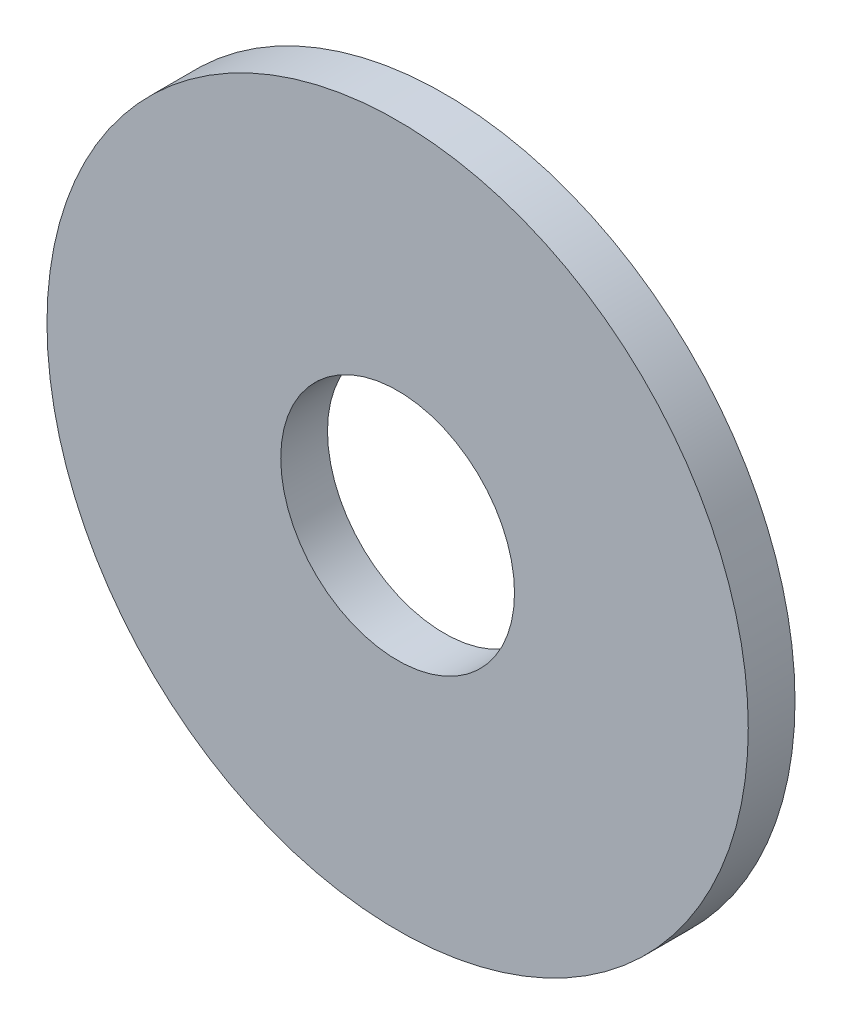
ISO-10303-21;
HEADER;
FILE_DESCRIPTION(('STEP AP214'),'2;1');
FILE_NAME('part.step','',(''),(''),'','','');
FILE_SCHEMA(('AUTOMOTIVE_DESIGN { 1 0 10303 214 1 1 1 1 }'));
ENDSEC;
DATA;
#1=APPLICATION_CONTEXT('core data for automotive mechanical design processes');
#2=APPLICATION_PROTOCOL_DEFINITION('international standard','automotive_design',2000,#1);
#3=PRODUCT_CONTEXT('',#1,'mechanical');
#4=PRODUCT('Part','Part','',(#3));
#5=PRODUCT_RELATED_PRODUCT_CATEGORY('part','',(#4));
#6=PRODUCT_DEFINITION_FORMATION('','',#4);
#7=PRODUCT_DEFINITION_CONTEXT('part definition',#1,'design');
#8=PRODUCT_DEFINITION('design','',#6,#7);
#9=PRODUCT_DEFINITION_SHAPE('','',#8);
#10=(LENGTH_UNIT() NAMED_UNIT(*) SI_UNIT(.MILLI.,.METRE.));
#11=(NAMED_UNIT(*) PLANE_ANGLE_UNIT() SI_UNIT($,.RADIAN.));
#12=(NAMED_UNIT(*) SI_UNIT($,.STERADIAN.) SOLID_ANGLE_UNIT());
#13=UNCERTAINTY_MEASURE_WITH_UNIT(LENGTH_MEASURE(1.E-05),#10,'distance_accuracy_value','');
#14=(GEOMETRIC_REPRESENTATION_CONTEXT(3) GLOBAL_UNCERTAINTY_ASSIGNED_CONTEXT((#13)) GLOBAL_UNIT_ASSIGNED_CONTEXT((#10,
#11,#12)) REPRESENTATION_CONTEXT('',''));
#15=CARTESIAN_POINT('',(0.,0.,0.));
#16=DIRECTION('',(0.,0.,1.));
#17=DIRECTION('',(1.,0.,0.));
#18=AXIS2_PLACEMENT_3D('',#15,#16,#17);
#19=CARTESIAN_POINT('',(0.,0.,1.));
#20=DIRECTION('',(0.,0.,1.));
#21=DIRECTION('',(1.,0.,0.));
#22=AXIS2_PLACEMENT_3D('',#19,#20,#21);
#23=PLANE('',#22);
#24=CARTESIAN_POINT('',(0.,0.,1.));
#25=DIRECTION('',(0.,0.,1.));
#26=DIRECTION('',(1.,0.,0.));
#27=AXIS2_PLACEMENT_3D('',#24,#25,#26);
#28=CIRCLE('',#27,7.5);
#29=CARTESIAN_POINT('',(7.5,0.,1.));
#30=VERTEX_POINT('',#29);
#31=EDGE_CURVE('E10',#30,#30,#28,.T.);
#32=ORIENTED_EDGE('',*,*,#31,.T.);
#33=EDGE_LOOP('',(#32));
#34=FACE_BOUND('',#33,.T.);
#35=CARTESIAN_POINT('',(0.,0.,1.));
#36=DIRECTION('',(0.,0.,1.));
#37=DIRECTION('',(1.,0.,0.));
#38=AXIS2_PLACEMENT_3D('',#35,#36,#37);
#39=CIRCLE('',#38,2.5);
#40=CARTESIAN_POINT('',(2.5,0.,1.));
#41=VERTEX_POINT('',#40);
#42=EDGE_CURVE('E42',#41,#41,#39,.T.);
#43=ORIENTED_EDGE('',*,*,#42,.F.);
#44=EDGE_LOOP('',(#43));
#45=FACE_BOUND('',#44,.T.);
#46=ADVANCED_FACE('F31',(#34,#45),#23,.T.);
#47=CARTESIAN_POINT('',(0.,0.,0.));
#48=DIRECTION('',(0.,0.,1.));
#49=DIRECTION('',(1.,0.,0.));
#50=AXIS2_PLACEMENT_3D('',#47,#48,#49);
#51=PLANE('',#50);
#52=CARTESIAN_POINT('',(0.,0.,0.));
#53=DIRECTION('',(0.,0.,1.));
#54=DIRECTION('',(1.,0.,0.));
#55=AXIS2_PLACEMENT_3D('',#52,#53,#54);
#56=CIRCLE('',#55,7.5);
#57=CARTESIAN_POINT('',(7.5,0.,0.));
#58=VERTEX_POINT('',#57);
#59=EDGE_CURVE('E35',#58,#58,#56,.T.);
#60=ORIENTED_EDGE('',*,*,#59,.F.);
#61=EDGE_LOOP('',(#60));
#62=FACE_BOUND('',#61,.T.);
#63=CARTESIAN_POINT('',(0.,0.,0.));
#64=DIRECTION('',(0.,0.,1.));
#65=DIRECTION('',(1.,0.,0.));
#66=AXIS2_PLACEMENT_3D('',#63,#64,#65);
#67=CIRCLE('',#66,2.5);
#68=CARTESIAN_POINT('',(2.5,0.,0.));
#69=VERTEX_POINT('',#68);
#70=EDGE_CURVE('E44',#69,#69,#67,.T.);
#71=ORIENTED_EDGE('',*,*,#70,.T.);
#72=EDGE_LOOP('',(#71));
#73=FACE_BOUND('',#72,.T.);
#74=ADVANCED_FACE('F54',(#62,#73),#51,.F.);
#75=CARTESIAN_POINT('',(0.,0.,1.));
#76=DIRECTION('',(0.,0.,-1.));
#77=DIRECTION('',(-1.,0.,0.));
#78=AXIS2_PLACEMENT_3D('',#75,#76,#77);
#79=CYLINDRICAL_SURFACE('',#78,7.5);
#80=ORIENTED_EDGE('',*,*,#31,.F.);
#81=EDGE_LOOP('',(#80));
#82=FACE_BOUND('',#81,.T.);
#83=ORIENTED_EDGE('',*,*,#59,.T.);
#84=EDGE_LOOP('',(#83));
#85=FACE_BOUND('',#84,.T.);
#86=ADVANCED_FACE('F33',(#82,#85),#79,.T.);
#87=CARTESIAN_POINT('',(0.,0.,1.));
#88=DIRECTION('',(0.,0.,-1.));
#89=DIRECTION('',(-1.,0.,0.));
#90=AXIS2_PLACEMENT_3D('',#87,#88,#89);
#91=CYLINDRICAL_SURFACE('',#90,2.5);
#92=ORIENTED_EDGE('',*,*,#42,.T.);
#93=EDGE_LOOP('',(#92));
#94=FACE_BOUND('',#93,.T.);
#95=ORIENTED_EDGE('',*,*,#70,.F.);
#96=EDGE_LOOP('',(#95));
#97=FACE_BOUND('',#96,.T.);
#98=ADVANCED_FACE('F50',(#94,#97),#91,.F.);
#99=CLOSED_SHELL('',(#46,#74,#86,#98));
#100=MANIFOLD_SOLID_BREP('B2',#99);
#101=ADVANCED_BREP_SHAPE_REPRESENTATION('',(#18,#100),#14);
#102=SHAPE_DEFINITION_REPRESENTATION(#9,#101);
ENDSEC;
END-ISO-10303-21;
